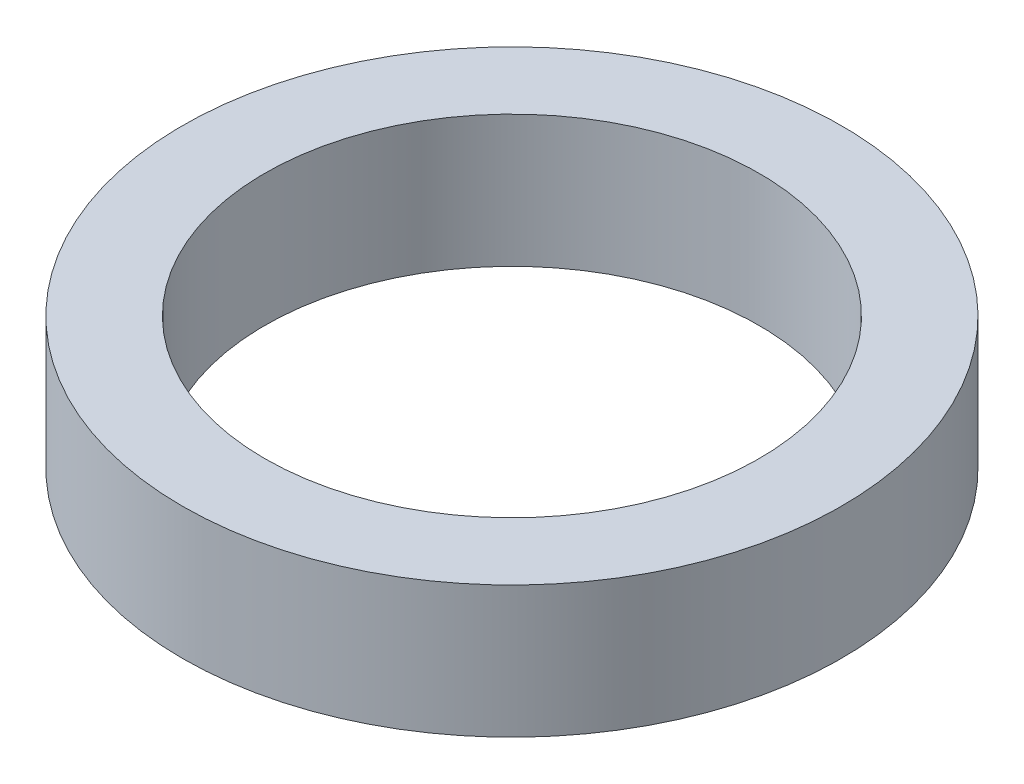
ISO-10303-21;
HEADER;
FILE_DESCRIPTION(('STEP AP214'),'2;1');
FILE_NAME('part.step','',(''),(''),'','','');
FILE_SCHEMA(('AUTOMOTIVE_DESIGN { 1 0 10303 214 1 1 1 1 }'));
ENDSEC;
DATA;
#1=APPLICATION_CONTEXT('core data for automotive mechanical design processes');
#2=APPLICATION_PROTOCOL_DEFINITION('international standard','automotive_design',2000,#1);
#3=PRODUCT_CONTEXT('',#1,'mechanical');
#4=PRODUCT('Part','Part','',(#3));
#5=PRODUCT_RELATED_PRODUCT_CATEGORY('part','',(#4));
#6=PRODUCT_DEFINITION_FORMATION('','',#4);
#7=PRODUCT_DEFINITION_CONTEXT('part definition',#1,'design');
#8=PRODUCT_DEFINITION('design','',#6,#7);
#9=PRODUCT_DEFINITION_SHAPE('','',#8);
#10=(LENGTH_UNIT() NAMED_UNIT(*) SI_UNIT(.MILLI.,.METRE.));
#11=(NAMED_UNIT(*) PLANE_ANGLE_UNIT() SI_UNIT($,.RADIAN.));
#12=(NAMED_UNIT(*) SI_UNIT($,.STERADIAN.) SOLID_ANGLE_UNIT());
#13=UNCERTAINTY_MEASURE_WITH_UNIT(LENGTH_MEASURE(1.E-05),#10,'distance_accuracy_value','');
#14=(GEOMETRIC_REPRESENTATION_CONTEXT(3) GLOBAL_UNCERTAINTY_ASSIGNED_CONTEXT((#13)) GLOBAL_UNIT_ASSIGNED_CONTEXT((#10,
#11,#12)) REPRESENTATION_CONTEXT('',''));
#15=CARTESIAN_POINT('',(0.,0.,0.));
#16=DIRECTION('',(0.,0.,1.));
#17=DIRECTION('',(1.,0.,0.));
#18=AXIS2_PLACEMENT_3D('',#15,#16,#17);
#19=CARTESIAN_POINT('',(0.,24.,0.));
#20=DIRECTION('',(0.,-1.,0.));
#21=DIRECTION('',(0.,0.,-1.));
#22=AXIS2_PLACEMENT_3D('',#19,#20,#21);
#23=CYLINDRICAL_SURFACE('',#22,60.);
#24=CARTESIAN_POINT('',(0.,24.,0.));
#25=DIRECTION('',(0.,1.,0.));
#26=DIRECTION('',(0.,0.,1.));
#27=AXIS2_PLACEMENT_3D('',#24,#25,#26);
#28=CIRCLE('',#27,60.);
#29=CARTESIAN_POINT('',(0.,24.,60.));
#30=VERTEX_POINT('',#29);
#31=EDGE_CURVE('E10',#30,#30,#28,.T.);
#32=ORIENTED_EDGE('',*,*,#31,.F.);
#33=EDGE_LOOP('',(#32));
#34=FACE_BOUND('',#33,.T.);
#35=CARTESIAN_POINT('',(0.,0.,0.));
#36=DIRECTION('',(0.,1.,0.));
#37=DIRECTION('',(0.,0.,1.));
#38=AXIS2_PLACEMENT_3D('',#35,#36,#37);
#39=CIRCLE('',#38,60.);
#40=CARTESIAN_POINT('',(0.,0.,60.));
#41=VERTEX_POINT('',#40);
#42=EDGE_CURVE('E37',#41,#41,#39,.T.);
#43=ORIENTED_EDGE('',*,*,#42,.T.);
#44=EDGE_LOOP('',(#43));
#45=FACE_BOUND('',#44,.T.);
#46=ADVANCED_FACE('F40',(#34,#45),#23,.T.);
#47=CARTESIAN_POINT('',(0.,24.,0.));
#48=DIRECTION('',(0.,1.,0.));
#49=DIRECTION('',(0.,0.,1.));
#50=AXIS2_PLACEMENT_3D('',#47,#48,#49);
#51=PLANE('',#50);
#52=CARTESIAN_POINT('',(0.,24.,0.));
#53=DIRECTION('',(0.,1.,0.));
#54=DIRECTION('',(0.,0.,1.));
#55=AXIS2_PLACEMENT_3D('',#52,#53,#54);
#56=CIRCLE('',#55,45.);
#57=CARTESIAN_POINT('',(0.,24.,45.));
#58=VERTEX_POINT('',#57);
#59=EDGE_CURVE('E50',#58,#58,#56,.T.);
#60=ORIENTED_EDGE('',*,*,#59,.F.);
#61=EDGE_LOOP('',(#60));
#62=FACE_BOUND('',#61,.T.);
#63=ORIENTED_EDGE('',*,*,#31,.T.);
#64=EDGE_LOOP('',(#63));
#65=FACE_BOUND('',#64,.T.);
#66=ADVANCED_FACE('F59',(#62,#65),#51,.T.);
#67=CARTESIAN_POINT('',(0.,0.,0.));
#68=DIRECTION('',(0.,1.,0.));
#69=DIRECTION('',(0.,0.,1.));
#70=AXIS2_PLACEMENT_3D('',#67,#68,#69);
#71=PLANE('',#70);
#72=CARTESIAN_POINT('',(0.,0.,0.));
#73=DIRECTION('',(0.,1.,0.));
#74=DIRECTION('',(0.,0.,1.));
#75=AXIS2_PLACEMENT_3D('',#72,#73,#74);
#76=CIRCLE('',#75,45.);
#77=CARTESIAN_POINT('',(0.,0.,45.));
#78=VERTEX_POINT('',#77);
#79=EDGE_CURVE('E47',#78,#78,#76,.T.);
#80=ORIENTED_EDGE('',*,*,#79,.T.);
#81=EDGE_LOOP('',(#80));
#82=FACE_BOUND('',#81,.T.);
#83=ORIENTED_EDGE('',*,*,#42,.F.);
#84=EDGE_LOOP('',(#83));
#85=FACE_BOUND('',#84,.T.);
#86=ADVANCED_FACE('F58',(#82,#85),#71,.F.);
#87=CARTESIAN_POINT('',(0.,24.,0.));
#88=DIRECTION('',(0.,-1.,0.));
#89=DIRECTION('',(0.,0.,-1.));
#90=AXIS2_PLACEMENT_3D('',#87,#88,#89);
#91=CYLINDRICAL_SURFACE('',#90,45.);
#92=ORIENTED_EDGE('',*,*,#59,.T.);
#93=EDGE_LOOP('',(#92));
#94=FACE_BOUND('',#93,.T.);
#95=ORIENTED_EDGE('',*,*,#79,.F.);
#96=EDGE_LOOP('',(#95));
#97=FACE_BOUND('',#96,.T.);
#98=ADVANCED_FACE('F54',(#94,#97),#91,.F.);
#99=CLOSED_SHELL('',(#46,#66,#86,#98));
#100=MANIFOLD_SOLID_BREP('B2',#99);
#101=ADVANCED_BREP_SHAPE_REPRESENTATION('',(#18,#100),#14);
#102=SHAPE_DEFINITION_REPRESENTATION(#9,#101);
ENDSEC;
END-ISO-10303-21;
